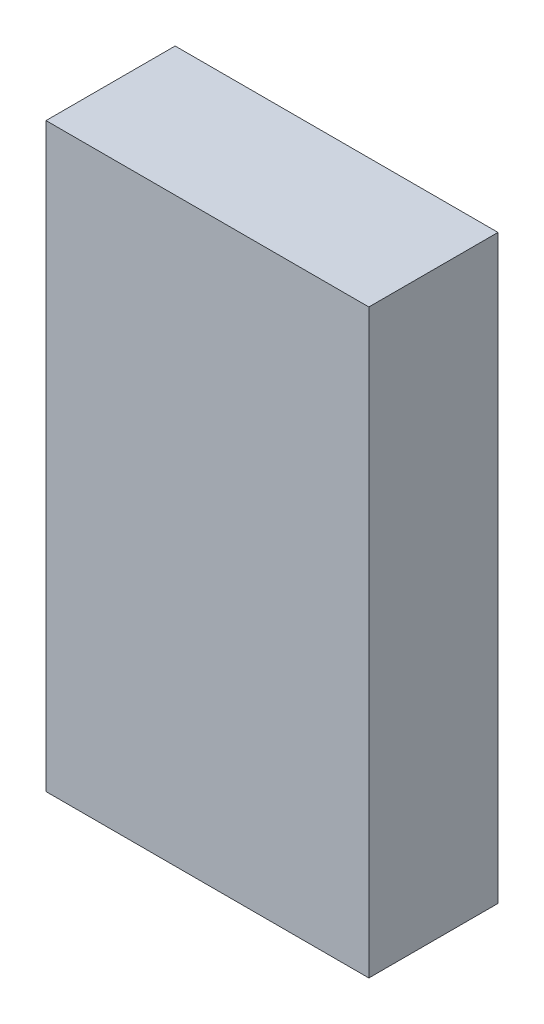
ISO-10303-21;
HEADER;
FILE_DESCRIPTION(('STEP AP214'),'2;1');
FILE_NAME('part.step','',(''),(''),'','','');
FILE_SCHEMA(('AUTOMOTIVE_DESIGN { 1 0 10303 214 1 1 1 1 }'));
ENDSEC;
DATA;
#1=APPLICATION_CONTEXT('core data for automotive mechanical design processes');
#2=APPLICATION_PROTOCOL_DEFINITION('international standard','automotive_design',2000,#1);
#3=PRODUCT_CONTEXT('',#1,'mechanical');
#4=PRODUCT('Part','Part','',(#3));
#5=PRODUCT_RELATED_PRODUCT_CATEGORY('part','',(#4));
#6=PRODUCT_DEFINITION_FORMATION('','',#4);
#7=PRODUCT_DEFINITION_CONTEXT('part definition',#1,'design');
#8=PRODUCT_DEFINITION('design','',#6,#7);
#9=PRODUCT_DEFINITION_SHAPE('','',#8);
#10=(LENGTH_UNIT() NAMED_UNIT(*) SI_UNIT(.MILLI.,.METRE.));
#11=(NAMED_UNIT(*) PLANE_ANGLE_UNIT() SI_UNIT($,.RADIAN.));
#12=(NAMED_UNIT(*) SI_UNIT($,.STERADIAN.) SOLID_ANGLE_UNIT());
#13=UNCERTAINTY_MEASURE_WITH_UNIT(LENGTH_MEASURE(1.E-05),#10,'distance_accuracy_value','');
#14=(GEOMETRIC_REPRESENTATION_CONTEXT(3) GLOBAL_UNCERTAINTY_ASSIGNED_CONTEXT((#13)) GLOBAL_UNIT_ASSIGNED_CONTEXT((#10,
#11,#12)) REPRESENTATION_CONTEXT('',''));
#15=CARTESIAN_POINT('',(0.,0.,0.));
#16=DIRECTION('',(0.,0.,1.));
#17=DIRECTION('',(1.,0.,0.));
#18=AXIS2_PLACEMENT_3D('',#15,#16,#17);
#19=CARTESIAN_POINT('',(-0.125,1.6,0.));
#20=DIRECTION('',(1.,0.,0.));
#21=DIRECTION('',(0.,0.,1.));
#22=AXIS2_PLACEMENT_3D('',#19,#20,#21);
#23=PLANE('',#22);
#24=DIRECTION('',(0.,1.,0.));
#25=VECTOR('',#24,1.);
#26=CARTESIAN_POINT('',(-0.125,1.6,0.1));
#27=LINE('',#26,#25);
#28=CARTESIAN_POINT('',(-0.125,1.6,0.1));
#29=VERTEX_POINT('',#28);
#30=CARTESIAN_POINT('',(-0.125,2.05,0.1));
#31=VERTEX_POINT('',#30);
#32=EDGE_CURVE('E11',#29,#31,#27,.T.);
#33=ORIENTED_EDGE('',*,*,#32,.T.);
#34=DIRECTION('',(0.,0.,1.));
#35=VECTOR('',#34,1.);
#36=CARTESIAN_POINT('',(-0.125,2.05,0.));
#37=LINE('',#36,#35);
#38=CARTESIAN_POINT('',(-0.125,2.05,0.));
#39=VERTEX_POINT('',#38);
#40=EDGE_CURVE('E24',#39,#31,#37,.T.);
#41=ORIENTED_EDGE('',*,*,#40,.F.);
#42=DIRECTION('',(0.,1.,0.));
#43=VECTOR('',#42,1.);
#44=CARTESIAN_POINT('',(-0.125,1.6,0.));
#45=LINE('',#44,#43);
#46=CARTESIAN_POINT('',(-0.125,1.6,0.));
#47=VERTEX_POINT('',#46);
#48=EDGE_CURVE('E86',#47,#39,#45,.T.);
#49=ORIENTED_EDGE('',*,*,#48,.F.);
#50=DIRECTION('',(0.,0.,1.));
#51=VECTOR('',#50,1.);
#52=CARTESIAN_POINT('',(-0.125,1.6,0.));
#53=LINE('',#52,#51);
#54=EDGE_CURVE('E36',#47,#29,#53,.T.);
#55=ORIENTED_EDGE('',*,*,#54,.T.);
#56=EDGE_LOOP('',(#33,#41,#49,#55));
#57=FACE_BOUND('',#56,.T.);
#58=ADVANCED_FACE('F17',(#57),#23,.F.);
#59=CARTESIAN_POINT('',(0.125,1.6,0.));
#60=DIRECTION('',(1.,0.,0.));
#61=DIRECTION('',(0.,0.,1.));
#62=AXIS2_PLACEMENT_3D('',#59,#60,#61);
#63=PLANE('',#62);
#64=DIRECTION('',(0.,0.,1.));
#65=VECTOR('',#64,1.);
#66=CARTESIAN_POINT('',(0.125,1.6,0.));
#67=LINE('',#66,#65);
#68=CARTESIAN_POINT('',(0.125,1.6,0.));
#69=VERTEX_POINT('',#68);
#70=CARTESIAN_POINT('',(0.125,1.6,0.1));
#71=VERTEX_POINT('',#70);
#72=EDGE_CURVE('E83',#69,#71,#67,.T.);
#73=ORIENTED_EDGE('',*,*,#72,.F.);
#74=DIRECTION('',(0.,1.,0.));
#75=VECTOR('',#74,1.);
#76=CARTESIAN_POINT('',(0.125,1.6,0.));
#77=LINE('',#76,#75);
#78=CARTESIAN_POINT('',(0.125,2.05,0.));
#79=VERTEX_POINT('',#78);
#80=EDGE_CURVE('E63',#69,#79,#77,.T.);
#81=ORIENTED_EDGE('',*,*,#80,.T.);
#82=DIRECTION('',(0.,0.,1.));
#83=VECTOR('',#82,1.);
#84=CARTESIAN_POINT('',(0.125,2.05,0.));
#85=LINE('',#84,#83);
#86=CARTESIAN_POINT('',(0.125,2.05,0.1));
#87=VERTEX_POINT('',#86);
#88=EDGE_CURVE('E57',#79,#87,#85,.T.);
#89=ORIENTED_EDGE('',*,*,#88,.T.);
#90=DIRECTION('',(0.,1.,0.));
#91=VECTOR('',#90,1.);
#92=CARTESIAN_POINT('',(0.125,1.6,0.1));
#93=LINE('',#92,#91);
#94=EDGE_CURVE('E60',#71,#87,#93,.T.);
#95=ORIENTED_EDGE('',*,*,#94,.F.);
#96=EDGE_LOOP('',(#73,#81,#89,#95));
#97=FACE_BOUND('',#96,.T.);
#98=ADVANCED_FACE('F59',(#97),#63,.T.);
#99=CARTESIAN_POINT('',(-0.125,1.6,0.));
#100=DIRECTION('',(0.,1.,0.));
#101=DIRECTION('',(0.,0.,1.));
#102=AXIS2_PLACEMENT_3D('',#99,#100,#101);
#103=PLANE('',#102);
#104=ORIENTED_EDGE('',*,*,#72,.T.);
#105=DIRECTION('',(1.,0.,0.));
#106=VECTOR('',#105,1.);
#107=CARTESIAN_POINT('',(-0.125,1.6,0.1));
#108=LINE('',#107,#106);
#109=EDGE_CURVE('E71',#29,#71,#108,.T.);
#110=ORIENTED_EDGE('',*,*,#109,.F.);
#111=ORIENTED_EDGE('',*,*,#54,.F.);
#112=DIRECTION('',(1.,0.,0.));
#113=VECTOR('',#112,1.);
#114=CARTESIAN_POINT('',(-0.125,1.6,0.));
#115=LINE('',#114,#113);
#116=EDGE_CURVE('E76',#47,#69,#115,.T.);
#117=ORIENTED_EDGE('',*,*,#116,.T.);
#118=EDGE_LOOP('',(#104,#110,#111,#117));
#119=FACE_BOUND('',#118,.T.);
#120=ADVANCED_FACE('F91',(#119),#103,.F.);
#121=CARTESIAN_POINT('',(-0.125,2.05,0.));
#122=DIRECTION('',(0.,1.,0.));
#123=DIRECTION('',(0.,0.,1.));
#124=AXIS2_PLACEMENT_3D('',#121,#122,#123);
#125=PLANE('',#124);
#126=DIRECTION('',(1.,0.,0.));
#127=VECTOR('',#126,1.);
#128=CARTESIAN_POINT('',(-0.125,2.05,0.));
#129=LINE('',#128,#127);
#130=EDGE_CURVE('E74',#39,#79,#129,.T.);
#131=ORIENTED_EDGE('',*,*,#130,.F.);
#132=ORIENTED_EDGE('',*,*,#40,.T.);
#133=DIRECTION('',(1.,0.,0.));
#134=VECTOR('',#133,1.);
#135=CARTESIAN_POINT('',(-0.125,2.05,0.1));
#136=LINE('',#135,#134);
#137=EDGE_CURVE('E69',#31,#87,#136,.T.);
#138=ORIENTED_EDGE('',*,*,#137,.T.);
#139=ORIENTED_EDGE('',*,*,#88,.F.);
#140=EDGE_LOOP('',(#131,#132,#138,#139));
#141=FACE_BOUND('',#140,.T.);
#142=ADVANCED_FACE('F73',(#141),#125,.T.);
#143=CARTESIAN_POINT('',(-0.125,1.6,0.));
#144=DIRECTION('',(0.,0.,1.));
#145=DIRECTION('',(1.,0.,0.));
#146=AXIS2_PLACEMENT_3D('',#143,#144,#145);
#147=PLANE('',#146);
#148=ORIENTED_EDGE('',*,*,#130,.T.);
#149=ORIENTED_EDGE('',*,*,#80,.F.);
#150=ORIENTED_EDGE('',*,*,#116,.F.);
#151=ORIENTED_EDGE('',*,*,#48,.T.);
#152=EDGE_LOOP('',(#148,#149,#150,#151));
#153=FACE_BOUND('',#152,.T.);
#154=ADVANCED_FACE('F89',(#153),#147,.F.);
#155=CARTESIAN_POINT('',(-0.125,1.6,0.1));
#156=DIRECTION('',(0.,0.,1.));
#157=DIRECTION('',(1.,0.,0.));
#158=AXIS2_PLACEMENT_3D('',#155,#156,#157);
#159=PLANE('',#158);
#160=ORIENTED_EDGE('',*,*,#32,.F.);
#161=ORIENTED_EDGE('',*,*,#109,.T.);
#162=ORIENTED_EDGE('',*,*,#94,.T.);
#163=ORIENTED_EDGE('',*,*,#137,.F.);
#164=EDGE_LOOP('',(#160,#161,#162,#163));
#165=FACE_BOUND('',#164,.T.);
#166=ADVANCED_FACE('F68',(#165),#159,.T.);
#167=CLOSED_SHELL('',(#58,#98,#120,#142,#154,#166));
#168=MANIFOLD_SOLID_BREP('B1',#167);
#169=ADVANCED_BREP_SHAPE_REPRESENTATION('',(#18,#168),#14);
#170=SHAPE_DEFINITION_REPRESENTATION(#9,#169);
ENDSEC;
END-ISO-10303-21;
